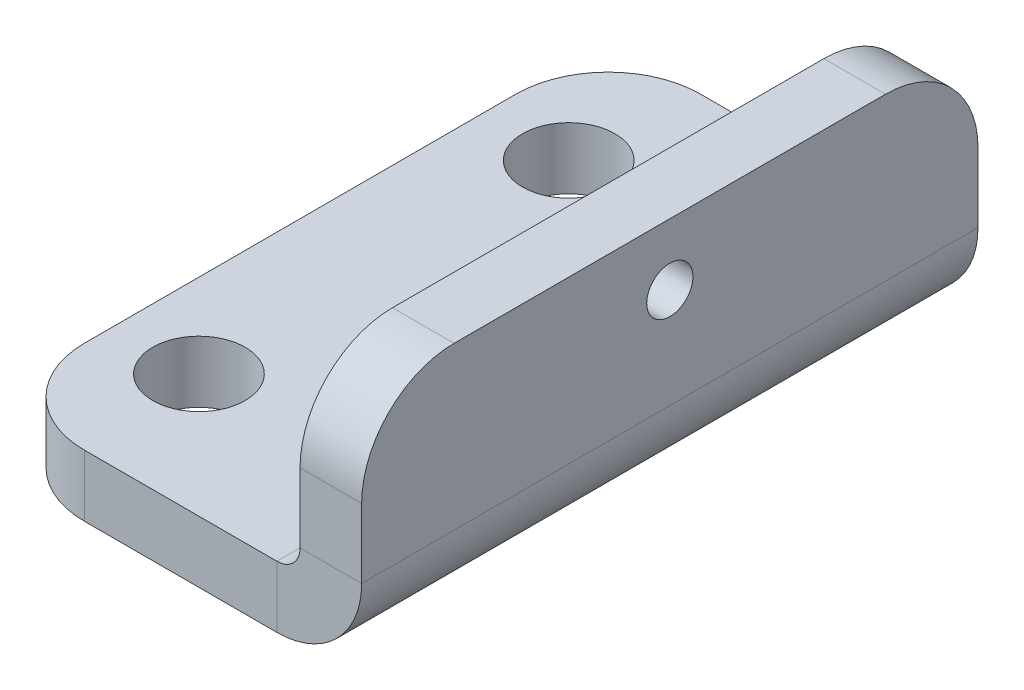
ISO-10303-21;
HEADER;
FILE_DESCRIPTION(('STEP AP214'),'2;1');
FILE_NAME('part.step','',(''),(''),'','','');
FILE_SCHEMA(('AUTOMOTIVE_DESIGN { 1 0 10303 214 1 1 1 1 }'));
ENDSEC;
DATA;
#1=APPLICATION_CONTEXT('core data for automotive mechanical design processes');
#2=APPLICATION_PROTOCOL_DEFINITION('international standard','automotive_design',2000,#1);
#3=PRODUCT_CONTEXT('',#1,'mechanical');
#4=PRODUCT('Part','Part','',(#3));
#5=PRODUCT_RELATED_PRODUCT_CATEGORY('part','',(#4));
#6=PRODUCT_DEFINITION_FORMATION('','',#4);
#7=PRODUCT_DEFINITION_CONTEXT('part definition',#1,'design');
#8=PRODUCT_DEFINITION('design','',#6,#7);
#9=PRODUCT_DEFINITION_SHAPE('','',#8);
#10=(LENGTH_UNIT() NAMED_UNIT(*) SI_UNIT(.MILLI.,.METRE.));
#11=(NAMED_UNIT(*) PLANE_ANGLE_UNIT() SI_UNIT($,.RADIAN.));
#12=(NAMED_UNIT(*) SI_UNIT($,.STERADIAN.) SOLID_ANGLE_UNIT());
#13=UNCERTAINTY_MEASURE_WITH_UNIT(LENGTH_MEASURE(1.E-05),#10,'distance_accuracy_value','');
#14=(GEOMETRIC_REPRESENTATION_CONTEXT(3) GLOBAL_UNCERTAINTY_ASSIGNED_CONTEXT((#13)) GLOBAL_UNIT_ASSIGNED_CONTEXT((#10,
#11,#12)) REPRESENTATION_CONTEXT('',''));
#15=CARTESIAN_POINT('',(0.,0.,0.));
#16=DIRECTION('',(0.,0.,1.));
#17=DIRECTION('',(1.,0.,0.));
#18=AXIS2_PLACEMENT_3D('',#15,#16,#17);
#19=CARTESIAN_POINT('',(-0.784240006319139,1.66880839771521,12.6));
#20=DIRECTION('',(0.,1.,0.));
#21=DIRECTION('',(0.,0.,1.));
#22=AXIS2_PLACEMENT_3D('',#19,#20,#21);
#23=PLANE('',#22);
#24=CARTESIAN_POINT('',(-1.28824000631915,1.66880839771521,-10.8));
#25=DIRECTION('',(0.,1.,0.));
#26=DIRECTION('',(0.,0.,1.));
#27=AXIS2_PLACEMENT_3D('',#24,#25,#26);
#28=CIRCLE('',#27,2.7);
#29=CARTESIAN_POINT('',(-1.28824000631915,1.66880839771521,-8.1));
#30=VERTEX_POINT('',#29);
#31=EDGE_CURVE('E222',#30,#30,#28,.T.);
#32=ORIENTED_EDGE('',*,*,#31,.F.);
#33=EDGE_LOOP('',(#32));
#34=FACE_BOUND('',#33,.T.);
#35=CARTESIAN_POINT('',(-1.28824000631914,1.66880839771521,10.8));
#36=DIRECTION('',(0.,1.,0.));
#37=DIRECTION('',(0.,0.,1.));
#38=AXIS2_PLACEMENT_3D('',#35,#36,#37);
#39=CIRCLE('',#38,2.7);
#40=CARTESIAN_POINT('',(-1.28824000631914,1.66880839771521,13.5));
#41=VERTEX_POINT('',#40);
#42=EDGE_CURVE('E216',#41,#41,#39,.T.);
#43=ORIENTED_EDGE('',*,*,#42,.F.);
#44=EDGE_LOOP('',(#43));
#45=FACE_BOUND('',#44,.T.);
#46=DIRECTION('',(1.,0.,0.));
#47=VECTOR('',#46,1.);
#48=CARTESIAN_POINT('',(-0.784240006319139,1.66880839771521,18.));
#49=LINE('',#48,#47);
#50=CARTESIAN_POINT('',(-0.784240006319139,1.66880839771521,18.));
#51=VERTEX_POINT('',#50);
#52=CARTESIAN_POINT('',(10.4657599936809,1.66880839771521,18.));
#53=VERTEX_POINT('',#52);
#54=EDGE_CURVE('E237',#51,#53,#49,.T.);
#55=ORIENTED_EDGE('',*,*,#54,.T.);
#56=DIRECTION('',(0.,0.,-1.));
#57=VECTOR('',#56,1.);
#58=CARTESIAN_POINT('',(10.4657599936809,1.66880839771521,-18.));
#59=LINE('',#58,#57);
#60=CARTESIAN_POINT('',(10.4657599936809,1.66880839771521,-18.));
#61=VERTEX_POINT('',#60);
#62=EDGE_CURVE('E206',#61,#53,#59,.F.);
#63=ORIENTED_EDGE('',*,*,#62,.F.);
#64=DIRECTION('',(-1.,0.,0.));
#65=VECTOR('',#64,1.);
#66=CARTESIAN_POINT('',(-0.78424000631915,1.66880839771521,-18.));
#67=LINE('',#66,#65);
#68=CARTESIAN_POINT('',(-0.78424000631915,1.66880839771521,-18.));
#69=VERTEX_POINT('',#68);
#70=EDGE_CURVE('E228',#61,#69,#67,.T.);
#71=ORIENTED_EDGE('',*,*,#70,.T.);
#72=CARTESIAN_POINT('',(-0.784240006319146,1.66880839771521,-12.6));
#73=DIRECTION('',(0.,1.,0.));
#74=DIRECTION('',(0.,0.,-1.));
#75=AXIS2_PLACEMENT_3D('',#72,#73,#74);
#76=CIRCLE('',#75,5.4);
#77=CARTESIAN_POINT('',(-6.18424000631915,1.66880839771521,-12.6));
#78=VERTEX_POINT('',#77);
#79=EDGE_CURVE('E230',#69,#78,#76,.T.);
#80=ORIENTED_EDGE('',*,*,#79,.T.);
#81=DIRECTION('',(0.,0.,1.));
#82=VECTOR('',#81,1.);
#83=CARTESIAN_POINT('',(-6.18424000631915,1.66880839771521,-12.6));
#84=LINE('',#83,#82);
#85=CARTESIAN_POINT('',(-6.18424000631914,1.66880839771521,12.6));
#86=VERTEX_POINT('',#85);
#87=EDGE_CURVE('E233',#78,#86,#84,.T.);
#88=ORIENTED_EDGE('',*,*,#87,.T.);
#89=CARTESIAN_POINT('',(-0.784240006319139,1.66880839771521,12.6));
#90=DIRECTION('',(0.,1.,0.));
#91=DIRECTION('',(0.,0.,1.));
#92=AXIS2_PLACEMENT_3D('',#89,#90,#91);
#93=CIRCLE('',#92,5.4);
#94=EDGE_CURVE('E235',#86,#51,#93,.T.);
#95=ORIENTED_EDGE('',*,*,#94,.T.);
#96=EDGE_LOOP('',(#55,#63,#71,#80,#88,#95));
#97=FACE_BOUND('',#96,.T.);
#98=ADVANCED_FACE('F62',(#34,#45,#97),#23,.T.);
#99=CARTESIAN_POINT('',(-0.784240006319139,-1.93119160228479,12.6));
#100=DIRECTION('',(0.,1.,0.));
#101=DIRECTION('',(0.,0.,1.));
#102=AXIS2_PLACEMENT_3D('',#99,#100,#101);
#103=PLANE('',#102);
#104=CARTESIAN_POINT('',(-1.28824000631914,-1.93119160228479,10.8));
#105=DIRECTION('',(0.,1.,0.));
#106=DIRECTION('',(0.,0.,1.));
#107=AXIS2_PLACEMENT_3D('',#104,#105,#106);
#108=CIRCLE('',#107,2.7);
#109=CARTESIAN_POINT('',(-1.28824000631914,-1.93119160228479,13.5));
#110=VERTEX_POINT('',#109);
#111=EDGE_CURVE('E213',#110,#110,#108,.T.);
#112=ORIENTED_EDGE('',*,*,#111,.T.);
#113=EDGE_LOOP('',(#112));
#114=FACE_BOUND('',#113,.T.);
#115=CARTESIAN_POINT('',(-1.28824000631915,-1.93119160228479,-10.8));
#116=DIRECTION('',(0.,1.,0.));
#117=DIRECTION('',(0.,0.,1.));
#118=AXIS2_PLACEMENT_3D('',#115,#116,#117);
#119=CIRCLE('',#118,2.7);
#120=CARTESIAN_POINT('',(-1.28824000631915,-1.93119160228479,-8.1));
#121=VERTEX_POINT('',#120);
#122=EDGE_CURVE('E219',#121,#121,#119,.T.);
#123=ORIENTED_EDGE('',*,*,#122,.T.);
#124=EDGE_LOOP('',(#123));
#125=FACE_BOUND('',#124,.T.);
#126=DIRECTION('',(0.,0.,-1.));
#127=VECTOR('',#126,1.);
#128=CARTESIAN_POINT('',(10.4657599936808,-1.93119160228479,-18.));
#129=LINE('',#128,#127);
#130=CARTESIAN_POINT('',(10.4657599936808,-1.93119160228479,-18.));
#131=VERTEX_POINT('',#130);
#132=CARTESIAN_POINT('',(10.4657599936809,-1.93119160228479,18.));
#133=VERTEX_POINT('',#132);
#134=EDGE_CURVE('E162',#131,#133,#129,.F.);
#135=ORIENTED_EDGE('',*,*,#134,.T.);
#136=DIRECTION('',(1.,0.,0.));
#137=VECTOR('',#136,1.);
#138=CARTESIAN_POINT('',(-0.784240006319139,-1.93119160228479,18.));
#139=LINE('',#138,#137);
#140=CARTESIAN_POINT('',(-0.784240006319139,-1.93119160228479,18.));
#141=VERTEX_POINT('',#140);
#142=EDGE_CURVE('E231',#141,#133,#139,.T.);
#143=ORIENTED_EDGE('',*,*,#142,.F.);
#144=CARTESIAN_POINT('',(-0.784240006319139,-1.93119160228479,12.6));
#145=DIRECTION('',(0.,1.,0.));
#146=DIRECTION('',(0.,0.,1.));
#147=AXIS2_PLACEMENT_3D('',#144,#145,#146);
#148=CIRCLE('',#147,5.4);
#149=CARTESIAN_POINT('',(-6.18424000631914,-1.93119160228479,12.6));
#150=VERTEX_POINT('',#149);
#151=EDGE_CURVE('E246',#150,#141,#148,.T.);
#152=ORIENTED_EDGE('',*,*,#151,.F.);
#153=DIRECTION('',(0.,0.,1.));
#154=VECTOR('',#153,1.);
#155=CARTESIAN_POINT('',(-6.18424000631915,-1.93119160228479,-12.6));
#156=LINE('',#155,#154);
#157=CARTESIAN_POINT('',(-6.18424000631915,-1.93119160228479,-12.6));
#158=VERTEX_POINT('',#157);
#159=EDGE_CURVE('E244',#158,#150,#156,.T.);
#160=ORIENTED_EDGE('',*,*,#159,.F.);
#161=CARTESIAN_POINT('',(-0.784240006319146,-1.93119160228479,-12.6));
#162=DIRECTION('',(0.,1.,0.));
#163=DIRECTION('',(0.,0.,-1.));
#164=AXIS2_PLACEMENT_3D('',#161,#162,#163);
#165=CIRCLE('',#164,5.4);
#166=CARTESIAN_POINT('',(-0.78424000631915,-1.93119160228479,-18.));
#167=VERTEX_POINT('',#166);
#168=EDGE_CURVE('E242',#167,#158,#165,.T.);
#169=ORIENTED_EDGE('',*,*,#168,.F.);
#170=DIRECTION('',(-1.,0.,0.));
#171=VECTOR('',#170,1.);
#172=CARTESIAN_POINT('',(-0.78424000631915,-1.93119160228479,-18.));
#173=LINE('',#172,#171);
#174=EDGE_CURVE('E225',#131,#167,#173,.T.);
#175=ORIENTED_EDGE('',*,*,#174,.F.);
#176=EDGE_LOOP('',(#135,#143,#152,#160,#169,#175));
#177=FACE_BOUND('',#176,.T.);
#178=ADVANCED_FACE('F306',(#114,#125,#177),#103,.F.);
#179=CARTESIAN_POINT('',(-0.78424000631915,1.66880839771521,-18.));
#180=DIRECTION('',(0.,0.,1.));
#181=DIRECTION('',(1.,0.,0.));
#182=AXIS2_PLACEMENT_3D('',#179,#180,#181);
#183=PLANE('',#182);
#184=DIRECTION('',(0.,-1.,0.));
#185=VECTOR('',#184,1.);
#186=CARTESIAN_POINT('',(10.4657599936809,1.66880839771521,-18.));
#187=LINE('',#186,#185);
#188=EDGE_CURVE('E202',#61,#131,#187,.T.);
#189=ORIENTED_EDGE('',*,*,#188,.T.);
#190=ORIENTED_EDGE('',*,*,#174,.T.);
#191=DIRECTION('',(0.,-1.,0.));
#192=VECTOR('',#191,1.);
#193=CARTESIAN_POINT('',(-0.78424000631915,1.66880839771521,-18.));
#194=LINE('',#193,#192);
#195=EDGE_CURVE('E257',#69,#167,#194,.T.);
#196=ORIENTED_EDGE('',*,*,#195,.F.);
#197=ORIENTED_EDGE('',*,*,#70,.F.);
#198=EDGE_LOOP('',(#189,#190,#196,#197));
#199=FACE_BOUND('',#198,.T.);
#200=ADVANCED_FACE('F311',(#199),#183,.F.);
#201=CARTESIAN_POINT('',(-0.784240006319139,1.66880839771521,18.));
#202=DIRECTION('',(0.,0.,-1.));
#203=DIRECTION('',(-1.,0.,0.));
#204=AXIS2_PLACEMENT_3D('',#201,#202,#203);
#205=PLANE('',#204);
#206=DIRECTION('',(0.,-1.,0.));
#207=VECTOR('',#206,1.);
#208=CARTESIAN_POINT('',(10.4657599936809,1.66880839771521,18.));
#209=LINE('',#208,#207);
#210=EDGE_CURVE('E210',#53,#133,#209,.T.);
#211=ORIENTED_EDGE('',*,*,#210,.F.);
#212=ORIENTED_EDGE('',*,*,#54,.F.);
#213=DIRECTION('',(0.,-1.,0.));
#214=VECTOR('',#213,1.);
#215=CARTESIAN_POINT('',(-0.784240006319139,1.66880839771521,18.));
#216=LINE('',#215,#214);
#217=EDGE_CURVE('E240',#51,#141,#216,.T.);
#218=ORIENTED_EDGE('',*,*,#217,.T.);
#219=ORIENTED_EDGE('',*,*,#142,.T.);
#220=EDGE_LOOP('',(#211,#212,#218,#219));
#221=FACE_BOUND('',#220,.T.);
#222=ADVANCED_FACE('F294',(#221),#205,.F.);
#223=CARTESIAN_POINT('',(-0.784240006319146,1.66880839771521,-12.6));
#224=DIRECTION('',(0.,-1.,0.));
#225=DIRECTION('',(0.,0.,-1.));
#226=AXIS2_PLACEMENT_3D('',#223,#224,#225);
#227=CYLINDRICAL_SURFACE('',#226,5.4);
#228=ORIENTED_EDGE('',*,*,#168,.T.);
#229=DIRECTION('',(0.,-1.,0.));
#230=VECTOR('',#229,1.);
#231=CARTESIAN_POINT('',(-6.18424000631915,1.66880839771521,-12.6));
#232=LINE('',#231,#230);
#233=EDGE_CURVE('E254',#78,#158,#232,.T.);
#234=ORIENTED_EDGE('',*,*,#233,.F.);
#235=ORIENTED_EDGE('',*,*,#79,.F.);
#236=ORIENTED_EDGE('',*,*,#195,.T.);
#237=EDGE_LOOP('',(#228,#234,#235,#236));
#238=FACE_BOUND('',#237,.T.);
#239=ADVANCED_FACE('F315',(#238),#227,.T.);
#240=CARTESIAN_POINT('',(-6.18424000631915,1.66880839771521,-12.6));
#241=DIRECTION('',(1.,0.,0.));
#242=DIRECTION('',(0.,0.,-1.));
#243=AXIS2_PLACEMENT_3D('',#240,#241,#242);
#244=PLANE('',#243);
#245=ORIENTED_EDGE('',*,*,#159,.T.);
#246=DIRECTION('',(0.,-1.,0.));
#247=VECTOR('',#246,1.);
#248=CARTESIAN_POINT('',(-6.18424000631914,1.66880839771521,12.6));
#249=LINE('',#248,#247);
#250=EDGE_CURVE('E251',#86,#150,#249,.T.);
#251=ORIENTED_EDGE('',*,*,#250,.F.);
#252=ORIENTED_EDGE('',*,*,#87,.F.);
#253=ORIENTED_EDGE('',*,*,#233,.T.);
#254=EDGE_LOOP('',(#245,#251,#252,#253));
#255=FACE_BOUND('',#254,.T.);
#256=ADVANCED_FACE('F317',(#255),#244,.F.);
#257=CARTESIAN_POINT('',(-0.784240006319139,1.66880839771521,12.6));
#258=DIRECTION('',(0.,-1.,0.));
#259=DIRECTION('',(0.,0.,-1.));
#260=AXIS2_PLACEMENT_3D('',#257,#258,#259);
#261=CYLINDRICAL_SURFACE('',#260,5.4);
#262=ORIENTED_EDGE('',*,*,#151,.T.);
#263=ORIENTED_EDGE('',*,*,#217,.F.);
#264=ORIENTED_EDGE('',*,*,#94,.F.);
#265=ORIENTED_EDGE('',*,*,#250,.T.);
#266=EDGE_LOOP('',(#262,#263,#264,#265));
#267=FACE_BOUND('',#266,.T.);
#268=ADVANCED_FACE('F303',(#267),#261,.T.);
#269=CARTESIAN_POINT('',(-1.28824000631915,1.66880839771521,-10.8));
#270=DIRECTION('',(0.,-1.,0.));
#271=DIRECTION('',(0.,0.,-1.));
#272=AXIS2_PLACEMENT_3D('',#269,#270,#271);
#273=CYLINDRICAL_SURFACE('',#272,2.7);
#274=ORIENTED_EDGE('',*,*,#31,.T.);
#275=EDGE_LOOP('',(#274));
#276=FACE_BOUND('',#275,.T.);
#277=ORIENTED_EDGE('',*,*,#122,.F.);
#278=EDGE_LOOP('',(#277));
#279=FACE_BOUND('',#278,.T.);
#280=ADVANCED_FACE('F324',(#276,#279),#273,.F.);
#281=CARTESIAN_POINT('',(-1.28824000631914,1.66880839771521,10.8));
#282=DIRECTION('',(0.,-1.,0.));
#283=DIRECTION('',(0.,0.,-1.));
#284=AXIS2_PLACEMENT_3D('',#281,#282,#283);
#285=CYLINDRICAL_SURFACE('',#284,2.7);
#286=ORIENTED_EDGE('',*,*,#42,.T.);
#287=EDGE_LOOP('',(#286));
#288=FACE_BOUND('',#287,.T.);
#289=ORIENTED_EDGE('',*,*,#111,.F.);
#290=EDGE_LOOP('',(#289));
#291=FACE_BOUND('',#290,.T.);
#292=ADVANCED_FACE('F378',(#288,#291),#285,.F.);
#293=CARTESIAN_POINT('',(10.4657599936809,3.01880839771521,18.));
#294=DIRECTION('',(0.,0.,1.));
#295=DIRECTION('',(1.,0.,0.));
#296=AXIS2_PLACEMENT_3D('',#293,#294,#295);
#297=PLANE('',#296);
#298=DIRECTION('',(-1.,0.,0.));
#299=VECTOR('',#298,1.);
#300=CARTESIAN_POINT('',(15.4157599936809,3.01880839771519,18.));
#301=LINE('',#300,#299);
#302=CARTESIAN_POINT('',(11.8157599936809,3.01880839771521,18.));
#303=VERTEX_POINT('',#302);
#304=CARTESIAN_POINT('',(15.4157599936809,3.0188083977152,18.));
#305=VERTEX_POINT('',#304);
#306=EDGE_CURVE('E196',#303,#305,#301,.F.);
#307=ORIENTED_EDGE('',*,*,#306,.F.);
#308=CARTESIAN_POINT('',(10.4657599936809,3.01880839771521,18.));
#309=DIRECTION('',(0.,0.,-1.));
#310=DIRECTION('',(-1.,0.,0.));
#311=AXIS2_PLACEMENT_3D('',#308,#309,#310);
#312=CIRCLE('',#311,1.35);
#313=EDGE_CURVE('E165',#53,#303,#312,.F.);
#314=ORIENTED_EDGE('',*,*,#313,.F.);
#315=ORIENTED_EDGE('',*,*,#210,.T.);
#316=CARTESIAN_POINT('',(10.4657599936809,3.01880839771521,18.));
#317=DIRECTION('',(0.,0.,-1.));
#318=DIRECTION('',(-1.,0.,0.));
#319=AXIS2_PLACEMENT_3D('',#316,#317,#318);
#320=CIRCLE('',#319,4.95);
#321=EDGE_CURVE('E201',#133,#305,#320,.F.);
#322=ORIENTED_EDGE('',*,*,#321,.T.);
#323=EDGE_LOOP('',(#307,#314,#315,#322));
#324=FACE_BOUND('',#323,.T.);
#325=ADVANCED_FACE('F291',(#324),#297,.T.);
#326=CARTESIAN_POINT('',(10.4657599936809,3.01880839771521,-18.));
#327=DIRECTION('',(0.,0.,1.));
#328=DIRECTION('',(1.,0.,0.));
#329=AXIS2_PLACEMENT_3D('',#326,#327,#328);
#330=PLANE('',#329);
#331=CARTESIAN_POINT('',(10.4657599936809,3.01880839771521,-18.));
#332=DIRECTION('',(0.,0.,-1.));
#333=DIRECTION('',(-1.,0.,0.));
#334=AXIS2_PLACEMENT_3D('',#331,#332,#333);
#335=CIRCLE('',#334,1.35);
#336=CARTESIAN_POINT('',(11.8157599936809,3.01880839771521,-18.));
#337=VERTEX_POINT('',#336);
#338=EDGE_CURVE('E172',#337,#61,#335,.T.);
#339=ORIENTED_EDGE('',*,*,#338,.F.);
#340=DIRECTION('',(-1.,0.,0.));
#341=VECTOR('',#340,1.);
#342=CARTESIAN_POINT('',(11.8157599936809,3.01880839771521,-18.));
#343=LINE('',#342,#341);
#344=CARTESIAN_POINT('',(15.4157599936809,3.0188083977152,-18.));
#345=VERTEX_POINT('',#344);
#346=EDGE_CURVE('E169',#337,#345,#343,.F.);
#347=ORIENTED_EDGE('',*,*,#346,.T.);
#348=CARTESIAN_POINT('',(10.4657599936809,3.01880839771521,-18.));
#349=DIRECTION('',(0.,0.,-1.));
#350=DIRECTION('',(-1.,0.,0.));
#351=AXIS2_PLACEMENT_3D('',#348,#349,#350);
#352=CIRCLE('',#351,4.95);
#353=EDGE_CURVE('E154',#345,#131,#352,.T.);
#354=ORIENTED_EDGE('',*,*,#353,.T.);
#355=ORIENTED_EDGE('',*,*,#188,.F.);
#356=EDGE_LOOP('',(#339,#347,#354,#355));
#357=FACE_BOUND('',#356,.T.);
#358=ADVANCED_FACE('F170',(#357),#330,.F.);
#359=CARTESIAN_POINT('',(10.4657599936809,3.01880839771521,-18.));
#360=DIRECTION('',(0.,0.,-1.));
#361=DIRECTION('',(1.,0.,0.));
#362=AXIS2_PLACEMENT_3D('',#359,#360,#361);
#363=CYLINDRICAL_SURFACE('',#362,4.95);
#364=ORIENTED_EDGE('',*,*,#134,.F.);
#365=ORIENTED_EDGE('',*,*,#353,.F.);
#366=DIRECTION('',(0.,0.,-1.));
#367=VECTOR('',#366,1.);
#368=CARTESIAN_POINT('',(15.4157599936809,3.01880839771519,18.));
#369=LINE('',#368,#367);
#370=EDGE_CURVE('E159',#345,#305,#369,.F.);
#371=ORIENTED_EDGE('',*,*,#370,.T.);
#372=ORIENTED_EDGE('',*,*,#321,.F.);
#373=EDGE_LOOP('',(#364,#365,#371,#372));
#374=FACE_BOUND('',#373,.T.);
#375=ADVANCED_FACE('F156',(#374),#363,.T.);
#376=CARTESIAN_POINT('',(10.4657599936809,3.01880839771521,-18.));
#377=DIRECTION('',(0.,0.,-1.));
#378=DIRECTION('',(1.,0.,0.));
#379=AXIS2_PLACEMENT_3D('',#376,#377,#378);
#380=CYLINDRICAL_SURFACE('',#379,1.35);
#381=ORIENTED_EDGE('',*,*,#62,.T.);
#382=ORIENTED_EDGE('',*,*,#313,.T.);
#383=DIRECTION('',(0.,0.,-1.));
#384=VECTOR('',#383,1.);
#385=CARTESIAN_POINT('',(11.8157599936809,3.01880839771521,18.));
#386=LINE('',#385,#384);
#387=EDGE_CURVE('E174',#303,#337,#386,.T.);
#388=ORIENTED_EDGE('',*,*,#387,.T.);
#389=ORIENTED_EDGE('',*,*,#338,.T.);
#390=EDGE_LOOP('',(#381,#382,#388,#389));
#391=FACE_BOUND('',#390,.T.);
#392=ADVANCED_FACE('F288',(#391),#380,.F.);
#393=CARTESIAN_POINT('',(15.4157599936809,12.4688083977152,-18.));
#394=DIRECTION('',(0.,0.,1.));
#395=DIRECTION('',(0.,-1.,0.));
#396=AXIS2_PLACEMENT_3D('',#393,#394,#395);
#397=PLANE('',#396);
#398=DIRECTION('',(0.,-1.,0.));
#399=VECTOR('',#398,1.);
#400=CARTESIAN_POINT('',(11.8157599936809,12.4688083977152,-18.));
#401=LINE('',#400,#399);
#402=CARTESIAN_POINT('',(11.8157599936809,7.06880839771522,-18.));
#403=VERTEX_POINT('',#402);
#404=EDGE_CURVE('E182',#337,#403,#401,.F.);
#405=ORIENTED_EDGE('',*,*,#404,.T.);
#406=DIRECTION('',(-1.,0.,0.));
#407=VECTOR('',#406,1.);
#408=CARTESIAN_POINT('',(15.4157599936809,7.06880839771521,-18.));
#409=LINE('',#408,#407);
#410=CARTESIAN_POINT('',(15.4157599936809,7.06880839771521,-18.));
#411=VERTEX_POINT('',#410);
#412=EDGE_CURVE('E13',#403,#411,#409,.F.);
#413=ORIENTED_EDGE('',*,*,#412,.T.);
#414=DIRECTION('',(0.,1.,0.));
#415=VECTOR('',#414,1.);
#416=CARTESIAN_POINT('',(15.4157599936808,-1.93119160228487,-18.));
#417=LINE('',#416,#415);
#418=EDGE_CURVE('E178',#345,#411,#417,.T.);
#419=ORIENTED_EDGE('',*,*,#418,.F.);
#420=ORIENTED_EDGE('',*,*,#346,.F.);
#421=EDGE_LOOP('',(#405,#413,#419,#420));
#422=FACE_BOUND('',#421,.T.);
#423=ADVANCED_FACE('F184',(#422),#397,.F.);
#424=CARTESIAN_POINT('',(15.4157599936809,1.6688083977152,18.));
#425=DIRECTION('',(0.,0.,-1.));
#426=DIRECTION('',(0.,1.,0.));
#427=AXIS2_PLACEMENT_3D('',#424,#425,#426);
#428=PLANE('',#427);
#429=DIRECTION('',(0.,-1.,0.));
#430=VECTOR('',#429,1.);
#431=CARTESIAN_POINT('',(15.4157599936808,-1.93119160228488,18.));
#432=LINE('',#431,#430);
#433=CARTESIAN_POINT('',(15.4157599936809,7.06880839771521,18.));
#434=VERTEX_POINT('',#433);
#435=EDGE_CURVE('E181',#434,#305,#432,.T.);
#436=ORIENTED_EDGE('',*,*,#435,.F.);
#437=DIRECTION('',(-1.,0.,0.));
#438=VECTOR('',#437,1.);
#439=CARTESIAN_POINT('',(15.4157599936809,7.06880839771521,18.));
#440=LINE('',#439,#438);
#441=CARTESIAN_POINT('',(11.8157599936809,7.06880839771522,18.));
#442=VERTEX_POINT('',#441);
#443=EDGE_CURVE('E260',#434,#442,#440,.T.);
#444=ORIENTED_EDGE('',*,*,#443,.T.);
#445=DIRECTION('',(0.,1.,0.));
#446=VECTOR('',#445,1.);
#447=CARTESIAN_POINT('',(11.8157599936809,1.66880839771521,18.));
#448=LINE('',#447,#446);
#449=EDGE_CURVE('E186',#442,#303,#448,.F.);
#450=ORIENTED_EDGE('',*,*,#449,.T.);
#451=ORIENTED_EDGE('',*,*,#306,.T.);
#452=EDGE_LOOP('',(#436,#444,#450,#451));
#453=FACE_BOUND('',#452,.T.);
#454=ADVANCED_FACE('F276',(#453),#428,.F.);
#455=CARTESIAN_POINT('',(15.4157599936808,-1.93119160228488,0.));
#456=DIRECTION('',(-1.,0.,0.));
#457=DIRECTION('',(0.,-1.,0.));
#458=AXIS2_PLACEMENT_3D('',#455,#456,#457);
#459=PLANE('',#458);
#460=CARTESIAN_POINT('',(15.4157599936809,8.86880839771521,0.));
#461=DIRECTION('',(-1.,0.,0.));
#462=DIRECTION('',(0.,-1.,0.));
#463=AXIS2_PLACEMENT_3D('',#460,#461,#462);
#464=CIRCLE('',#463,1.35);
#465=CARTESIAN_POINT('',(15.4157599936809,7.51880839771521,0.));
#466=VERTEX_POINT('',#465);
#467=EDGE_CURVE('E199',#466,#466,#464,.T.);
#468=ORIENTED_EDGE('',*,*,#467,.T.);
#469=EDGE_LOOP('',(#468));
#470=FACE_BOUND('',#469,.T.);
#471=DIRECTION('',(0.,0.,1.));
#472=VECTOR('',#471,1.);
#473=CARTESIAN_POINT('',(15.4157599936809,12.4688083977152,0.));
#474=LINE('',#473,#472);
#475=CARTESIAN_POINT('',(15.4157599936809,12.4688083977152,-12.6));
#476=VERTEX_POINT('',#475);
#477=CARTESIAN_POINT('',(15.4157599936809,12.4688083977152,12.6));
#478=VERTEX_POINT('',#477);
#479=EDGE_CURVE('E185',#476,#478,#474,.T.);
#480=ORIENTED_EDGE('',*,*,#479,.T.);
#481=CARTESIAN_POINT('',(15.4157599936809,7.06880839771521,12.6));
#482=DIRECTION('',(-1.,0.,0.));
#483=DIRECTION('',(0.,-1.,0.));
#484=AXIS2_PLACEMENT_3D('',#481,#482,#483);
#485=CIRCLE('',#484,5.4);
#486=EDGE_CURVE('E70',#478,#434,#485,.F.);
#487=ORIENTED_EDGE('',*,*,#486,.T.);
#488=ORIENTED_EDGE('',*,*,#435,.T.);
#489=ORIENTED_EDGE('',*,*,#370,.F.);
#490=ORIENTED_EDGE('',*,*,#418,.T.);
#491=CARTESIAN_POINT('',(15.4157599936809,7.06880839771521,-12.6));
#492=DIRECTION('',(-1.,0.,0.));
#493=DIRECTION('',(0.,-1.,0.));
#494=AXIS2_PLACEMENT_3D('',#491,#492,#493);
#495=CIRCLE('',#494,5.4);
#496=EDGE_CURVE('E271',#411,#476,#495,.F.);
#497=ORIENTED_EDGE('',*,*,#496,.T.);
#498=EDGE_LOOP('',(#480,#487,#488,#489,#490,#497));
#499=FACE_BOUND('',#498,.T.);
#500=ADVANCED_FACE('F177',(#470,#499),#459,.F.);
#501=CARTESIAN_POINT('',(11.8157599936808,-1.93119160228486,0.));
#502=DIRECTION('',(-1.,0.,0.));
#503=DIRECTION('',(0.,-1.,0.));
#504=AXIS2_PLACEMENT_3D('',#501,#502,#503);
#505=PLANE('',#504);
#506=CARTESIAN_POINT('',(11.8157599936809,8.86880839771522,0.));
#507=DIRECTION('',(-1.,0.,0.));
#508=DIRECTION('',(0.,-1.,0.));
#509=AXIS2_PLACEMENT_3D('',#506,#507,#508);
#510=CIRCLE('',#509,1.35);
#511=CARTESIAN_POINT('',(11.8157599936809,7.51880839771522,0.));
#512=VERTEX_POINT('',#511);
#513=EDGE_CURVE('E549',#512,#512,#510,.T.);
#514=ORIENTED_EDGE('',*,*,#513,.F.);
#515=EDGE_LOOP('',(#514));
#516=FACE_BOUND('',#515,.T.);
#517=ORIENTED_EDGE('',*,*,#449,.F.);
#518=CARTESIAN_POINT('',(11.8157599936809,7.06880839771522,12.6));
#519=DIRECTION('',(-1.,0.,0.));
#520=DIRECTION('',(0.,-1.,0.));
#521=AXIS2_PLACEMENT_3D('',#518,#519,#520);
#522=CIRCLE('',#521,5.4);
#523=CARTESIAN_POINT('',(11.8157599936809,12.4688083977152,12.6));
#524=VERTEX_POINT('',#523);
#525=EDGE_CURVE('E265',#442,#524,#522,.T.);
#526=ORIENTED_EDGE('',*,*,#525,.T.);
#527=DIRECTION('',(0.,0.,-1.));
#528=VECTOR('',#527,1.);
#529=CARTESIAN_POINT('',(11.8157599936809,12.4688083977152,18.));
#530=LINE('',#529,#528);
#531=CARTESIAN_POINT('',(11.8157599936809,12.4688083977152,-12.6));
#532=VERTEX_POINT('',#531);
#533=EDGE_CURVE('E189',#532,#524,#530,.F.);
#534=ORIENTED_EDGE('',*,*,#533,.F.);
#535=CARTESIAN_POINT('',(11.8157599936809,7.06880839771522,-12.6));
#536=DIRECTION('',(-1.,0.,0.));
#537=DIRECTION('',(0.,-1.,0.));
#538=AXIS2_PLACEMENT_3D('',#535,#536,#537);
#539=CIRCLE('',#538,5.4);
#540=EDGE_CURVE('E263',#532,#403,#539,.T.);
#541=ORIENTED_EDGE('',*,*,#540,.T.);
#542=ORIENTED_EDGE('',*,*,#404,.F.);
#543=ORIENTED_EDGE('',*,*,#387,.F.);
#544=EDGE_LOOP('',(#517,#526,#534,#541,#542,#543));
#545=FACE_BOUND('',#544,.T.);
#546=ADVANCED_FACE('F282',(#516,#545),#505,.T.);
#547=CARTESIAN_POINT('',(15.4157599936809,12.4688083977152,18.));
#548=DIRECTION('',(0.,-1.,0.));
#549=DIRECTION('',(1.,0.,0.));
#550=AXIS2_PLACEMENT_3D('',#547,#548,#549);
#551=PLANE('',#550);
#552=ORIENTED_EDGE('',*,*,#533,.T.);
#553=DIRECTION('',(-1.,0.,0.));
#554=VECTOR('',#553,1.);
#555=CARTESIAN_POINT('',(15.4157599936809,12.4688083977152,12.6));
#556=LINE('',#555,#554);
#557=EDGE_CURVE('E83',#524,#478,#556,.F.);
#558=ORIENTED_EDGE('',*,*,#557,.T.);
#559=ORIENTED_EDGE('',*,*,#479,.F.);
#560=DIRECTION('',(-1.,0.,0.));
#561=VECTOR('',#560,1.);
#562=CARTESIAN_POINT('',(15.4157599936809,12.4688083977152,-12.6));
#563=LINE('',#562,#561);
#564=EDGE_CURVE('E267',#476,#532,#563,.T.);
#565=ORIENTED_EDGE('',*,*,#564,.T.);
#566=EDGE_LOOP('',(#552,#558,#559,#565));
#567=FACE_BOUND('',#566,.T.);
#568=ADVANCED_FACE('F284',(#567),#551,.F.);
#569=CARTESIAN_POINT('',(29.8157599936809,8.86880839771516,0.));
#570=DIRECTION('',(-1.,0.,0.));
#571=DIRECTION('',(0.,-1.,0.));
#572=AXIS2_PLACEMENT_3D('',#569,#570,#571);
#573=CYLINDRICAL_SURFACE('',#572,1.35);
#574=ORIENTED_EDGE('',*,*,#513,.T.);
#575=EDGE_LOOP('',(#574));
#576=FACE_BOUND('',#575,.T.);
#577=ORIENTED_EDGE('',*,*,#467,.F.);
#578=EDGE_LOOP('',(#577));
#579=FACE_BOUND('',#578,.T.);
#580=ADVANCED_FACE('F348',(#576,#579),#573,.F.);
#581=CARTESIAN_POINT('',(15.4157599936809,7.06880839771521,12.6));
#582=DIRECTION('',(-1.,0.,0.));
#583=DIRECTION('',(0.,-1.,0.));
#584=AXIS2_PLACEMENT_3D('',#581,#582,#583);
#585=CYLINDRICAL_SURFACE('',#584,5.4);
#586=ORIENTED_EDGE('',*,*,#486,.F.);
#587=ORIENTED_EDGE('',*,*,#557,.F.);
#588=ORIENTED_EDGE('',*,*,#525,.F.);
#589=ORIENTED_EDGE('',*,*,#443,.F.);
#590=EDGE_LOOP('',(#586,#587,#588,#589));
#591=FACE_BOUND('',#590,.T.);
#592=ADVANCED_FACE('F279',(#591),#585,.T.);
#593=CARTESIAN_POINT('',(15.4157599936809,7.06880839771521,-12.6));
#594=DIRECTION('',(-1.,0.,0.));
#595=DIRECTION('',(0.,-1.,0.));
#596=AXIS2_PLACEMENT_3D('',#593,#594,#595);
#597=CYLINDRICAL_SURFACE('',#596,5.4);
#598=ORIENTED_EDGE('',*,*,#496,.F.);
#599=ORIENTED_EDGE('',*,*,#412,.F.);
#600=ORIENTED_EDGE('',*,*,#540,.F.);
#601=ORIENTED_EDGE('',*,*,#564,.F.);
#602=EDGE_LOOP('',(#598,#599,#600,#601));
#603=FACE_BOUND('',#602,.T.);
#604=ADVANCED_FACE('F64',(#603),#597,.T.);
#605=CLOSED_SHELL('',(#98,#178,#200,#222,#239,#256,#268,#280,#292,#325,#358,#375,#392,#423,#454,
#500,#546,#568,#580,#592,#604));
#606=MANIFOLD_SOLID_BREP('B2',#605);
#607=ADVANCED_BREP_SHAPE_REPRESENTATION('',(#18,#606),#14);
#608=SHAPE_DEFINITION_REPRESENTATION(#9,#607);
ENDSEC;
END-ISO-10303-21;
